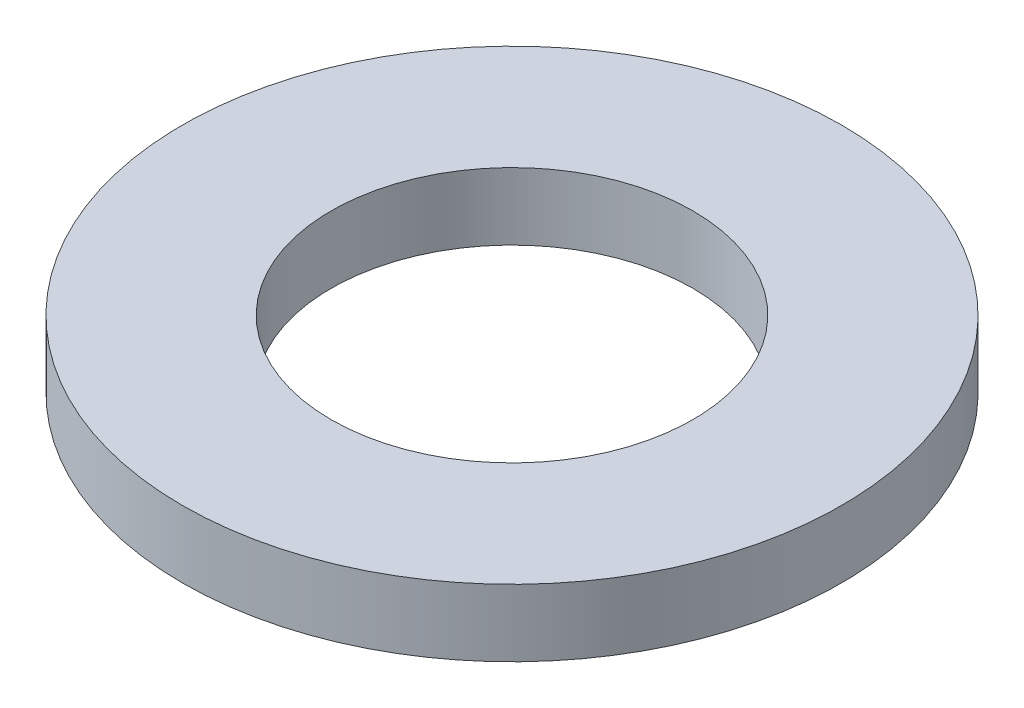
ISO-10303-21;
HEADER;
FILE_DESCRIPTION(('STEP AP214'),'2;1');
FILE_NAME('part.step','',(''),(''),'','','');
FILE_SCHEMA(('AUTOMOTIVE_DESIGN { 1 0 10303 214 1 1 1 1 }'));
ENDSEC;
DATA;
#1=APPLICATION_CONTEXT('core data for automotive mechanical design processes');
#2=APPLICATION_PROTOCOL_DEFINITION('international standard','automotive_design',2000,#1);
#3=PRODUCT_CONTEXT('',#1,'mechanical');
#4=PRODUCT('Part','Part','',(#3));
#5=PRODUCT_RELATED_PRODUCT_CATEGORY('part','',(#4));
#6=PRODUCT_DEFINITION_FORMATION('','',#4);
#7=PRODUCT_DEFINITION_CONTEXT('part definition',#1,'design');
#8=PRODUCT_DEFINITION('design','',#6,#7);
#9=PRODUCT_DEFINITION_SHAPE('','',#8);
#10=(LENGTH_UNIT() NAMED_UNIT(*) SI_UNIT(.MILLI.,.METRE.));
#11=(NAMED_UNIT(*) PLANE_ANGLE_UNIT() SI_UNIT($,.RADIAN.));
#12=(NAMED_UNIT(*) SI_UNIT($,.STERADIAN.) SOLID_ANGLE_UNIT());
#13=UNCERTAINTY_MEASURE_WITH_UNIT(LENGTH_MEASURE(1.E-05),#10,'distance_accuracy_value','');
#14=(GEOMETRIC_REPRESENTATION_CONTEXT(3) GLOBAL_UNCERTAINTY_ASSIGNED_CONTEXT((#13)) GLOBAL_UNIT_ASSIGNED_CONTEXT((#10,
#11,#12)) REPRESENTATION_CONTEXT('',''));
#15=CARTESIAN_POINT('',(0.,0.,0.));
#16=DIRECTION('',(0.,0.,1.));
#17=DIRECTION('',(1.,0.,0.));
#18=AXIS2_PLACEMENT_3D('',#15,#16,#17);
#19=CARTESIAN_POINT('',(0.,0.5,0.));
#20=DIRECTION('',(0.,1.,0.));
#21=DIRECTION('',(0.,0.,1.));
#22=AXIS2_PLACEMENT_3D('',#19,#20,#21);
#23=PLANE('',#22);
#24=CARTESIAN_POINT('',(0.,0.5,0.));
#25=DIRECTION('',(0.,1.,0.));
#26=DIRECTION('',(0.,0.,1.));
#27=AXIS2_PLACEMENT_3D('',#24,#25,#26);
#28=CIRCLE('',#27,4.91);
#29=CARTESIAN_POINT('',(0.,0.5,4.91));
#30=VERTEX_POINT('',#29);
#31=EDGE_CURVE('E10',#30,#30,#28,.T.);
#32=ORIENTED_EDGE('',*,*,#31,.T.);
#33=EDGE_LOOP('',(#32));
#34=FACE_BOUND('',#33,.T.);
#35=CARTESIAN_POINT('',(0.,0.5,0.));
#36=DIRECTION('',(0.,1.,0.));
#37=DIRECTION('',(0.,0.,1.));
#38=AXIS2_PLACEMENT_3D('',#35,#36,#37);
#39=CIRCLE('',#38,2.695);
#40=CARTESIAN_POINT('',(0.,0.5,2.695));
#41=VERTEX_POINT('',#40);
#42=EDGE_CURVE('E43',#41,#41,#39,.T.);
#43=ORIENTED_EDGE('',*,*,#42,.F.);
#44=EDGE_LOOP('',(#43));
#45=FACE_BOUND('',#44,.T.);
#46=ADVANCED_FACE('F32',(#34,#45),#23,.T.);
#47=CARTESIAN_POINT('',(0.,-0.5,0.));
#48=DIRECTION('',(0.,1.,0.));
#49=DIRECTION('',(0.,0.,1.));
#50=AXIS2_PLACEMENT_3D('',#47,#48,#49);
#51=PLANE('',#50);
#52=CARTESIAN_POINT('',(0.,-0.5,0.));
#53=DIRECTION('',(0.,1.,0.));
#54=DIRECTION('',(0.,0.,1.));
#55=AXIS2_PLACEMENT_3D('',#52,#53,#54);
#56=CIRCLE('',#55,4.91);
#57=CARTESIAN_POINT('',(0.,-0.5,4.91));
#58=VERTEX_POINT('',#57);
#59=EDGE_CURVE('E36',#58,#58,#56,.T.);
#60=ORIENTED_EDGE('',*,*,#59,.F.);
#61=EDGE_LOOP('',(#60));
#62=FACE_BOUND('',#61,.T.);
#63=CARTESIAN_POINT('',(0.,-0.5,0.));
#64=DIRECTION('',(0.,1.,0.));
#65=DIRECTION('',(0.,0.,1.));
#66=AXIS2_PLACEMENT_3D('',#63,#64,#65);
#67=CIRCLE('',#66,2.695);
#68=CARTESIAN_POINT('',(0.,-0.5,2.695));
#69=VERTEX_POINT('',#68);
#70=EDGE_CURVE('E45',#69,#69,#67,.T.);
#71=ORIENTED_EDGE('',*,*,#70,.T.);
#72=EDGE_LOOP('',(#71));
#73=FACE_BOUND('',#72,.T.);
#74=ADVANCED_FACE('F55',(#62,#73),#51,.F.);
#75=CARTESIAN_POINT('',(0.,0.5,0.));
#76=DIRECTION('',(0.,-1.,0.));
#77=DIRECTION('',(0.,0.,-1.));
#78=AXIS2_PLACEMENT_3D('',#75,#76,#77);
#79=CYLINDRICAL_SURFACE('',#78,4.91);
#80=ORIENTED_EDGE('',*,*,#31,.F.);
#81=EDGE_LOOP('',(#80));
#82=FACE_BOUND('',#81,.T.);
#83=ORIENTED_EDGE('',*,*,#59,.T.);
#84=EDGE_LOOP('',(#83));
#85=FACE_BOUND('',#84,.T.);
#86=ADVANCED_FACE('F34',(#82,#85),#79,.T.);
#87=CARTESIAN_POINT('',(0.,0.5,0.));
#88=DIRECTION('',(0.,-1.,0.));
#89=DIRECTION('',(0.,0.,-1.));
#90=AXIS2_PLACEMENT_3D('',#87,#88,#89);
#91=CYLINDRICAL_SURFACE('',#90,2.695);
#92=ORIENTED_EDGE('',*,*,#42,.T.);
#93=EDGE_LOOP('',(#92));
#94=FACE_BOUND('',#93,.T.);
#95=ORIENTED_EDGE('',*,*,#70,.F.);
#96=EDGE_LOOP('',(#95));
#97=FACE_BOUND('',#96,.T.);
#98=ADVANCED_FACE('F51',(#94,#97),#91,.F.);
#99=CLOSED_SHELL('',(#46,#74,#86,#98));
#100=MANIFOLD_SOLID_BREP('B2',#99);
#101=ADVANCED_BREP_SHAPE_REPRESENTATION('',(#18,#100),#14);
#102=SHAPE_DEFINITION_REPRESENTATION(#9,#101);
ENDSEC;
END-ISO-10303-21;
